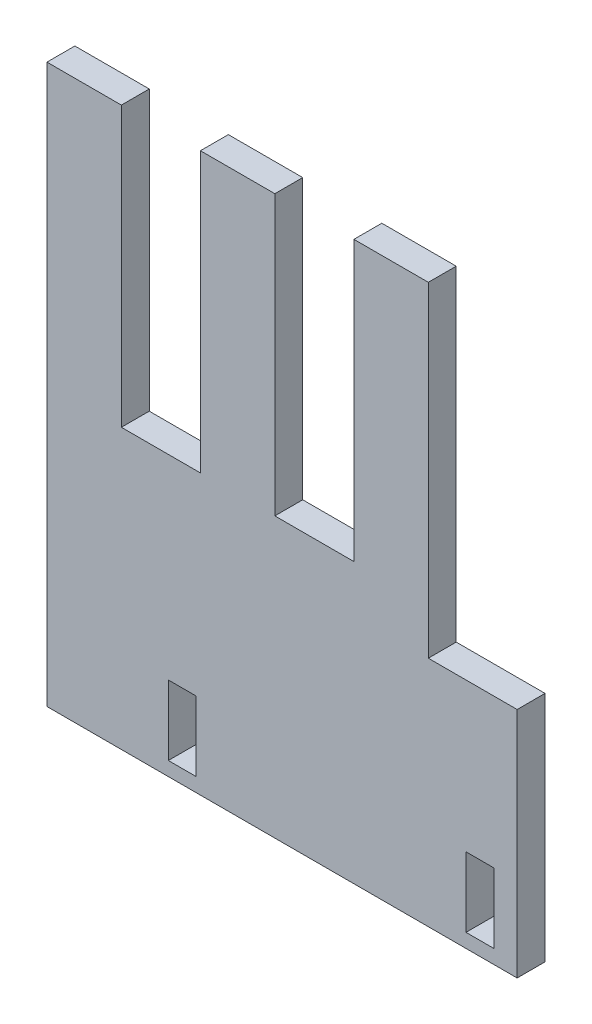
ISO-10303-21;
HEADER;
FILE_DESCRIPTION(('STEP AP214'),'2;1');
FILE_NAME('part.step','',(''),(''),'','','');
FILE_SCHEMA(('AUTOMOTIVE_DESIGN { 1 0 10303 214 1 1 1 1 }'));
ENDSEC;
DATA;
#1=APPLICATION_CONTEXT('core data for automotive mechanical design processes');
#2=APPLICATION_PROTOCOL_DEFINITION('international standard','automotive_design',2000,#1);
#3=PRODUCT_CONTEXT('',#1,'mechanical');
#4=PRODUCT('Part','Part','',(#3));
#5=PRODUCT_RELATED_PRODUCT_CATEGORY('part','',(#4));
#6=PRODUCT_DEFINITION_FORMATION('','',#4);
#7=PRODUCT_DEFINITION_CONTEXT('part definition',#1,'design');
#8=PRODUCT_DEFINITION('design','',#6,#7);
#9=PRODUCT_DEFINITION_SHAPE('','',#8);
#10=(LENGTH_UNIT() NAMED_UNIT(*) SI_UNIT(.MILLI.,.METRE.));
#11=(NAMED_UNIT(*) PLANE_ANGLE_UNIT() SI_UNIT($,.RADIAN.));
#12=(NAMED_UNIT(*) SI_UNIT($,.STERADIAN.) SOLID_ANGLE_UNIT());
#13=UNCERTAINTY_MEASURE_WITH_UNIT(LENGTH_MEASURE(1.E-05),#10,'distance_accuracy_value','');
#14=(GEOMETRIC_REPRESENTATION_CONTEXT(3) GLOBAL_UNCERTAINTY_ASSIGNED_CONTEXT((#13)) GLOBAL_UNIT_ASSIGNED_CONTEXT((#10,
#11,#12)) REPRESENTATION_CONTEXT('',''));
#15=CARTESIAN_POINT('',(0.,0.,0.));
#16=DIRECTION('',(0.,0.,1.));
#17=DIRECTION('',(1.,0.,0.));
#18=AXIS2_PLACEMENT_3D('',#15,#16,#17);
#19=CARTESIAN_POINT('',(0.,0.,6.));
#20=DIRECTION('',(0.,0.,1.));
#21=DIRECTION('',(1.,0.,0.));
#22=AXIS2_PLACEMENT_3D('',#19,#20,#21);
#23=PLANE('',#22);
#24=DIRECTION('',(-1.,0.,0.));
#25=VECTOR('',#24,1.);
#26=CARTESIAN_POINT('',(-24.8324162415232,47.3812849162011,6.));
#27=LINE('',#26,#25);
#28=CARTESIAN_POINT('',(-24.8324162415232,47.3812849162011,6.));
#29=VERTEX_POINT('',#28);
#30=CARTESIAN_POINT('',(-40.8324162415232,47.3812849162011,6.));
#31=VERTEX_POINT('',#30);
#32=EDGE_CURVE('E249',#29,#31,#27,.T.);
#33=ORIENTED_EDGE('',*,*,#32,.T.);
#34=DIRECTION('',(0.,-1.,0.));
#35=VECTOR('',#34,1.);
#36=CARTESIAN_POINT('',(-40.8324162415232,47.3812849162011,6.));
#37=LINE('',#36,#35);
#38=CARTESIAN_POINT('',(-40.8324162415232,-72.6187150837989,6.));
#39=VERTEX_POINT('',#38);
#40=EDGE_CURVE('E252',#31,#39,#37,.T.);
#41=ORIENTED_EDGE('',*,*,#40,.T.);
#42=DIRECTION('',(1.,0.,0.));
#43=VECTOR('',#42,1.);
#44=CARTESIAN_POINT('',(-40.8324162415232,-72.6187150837989,6.));
#45=LINE('',#44,#43);
#46=CARTESIAN_POINT('',(60.2675837584768,-72.6187150837989,6.));
#47=VERTEX_POINT('',#46);
#48=EDGE_CURVE('E255',#39,#47,#45,.T.);
#49=ORIENTED_EDGE('',*,*,#48,.T.);
#50=DIRECTION('',(0.,1.,0.));
#51=VECTOR('',#50,1.);
#52=CARTESIAN_POINT('',(60.2675837584768,-22.6187150837989,6.));
#53=LINE('',#52,#51);
#54=CARTESIAN_POINT('',(60.2675837584768,-22.6187150837989,6.));
#55=VERTEX_POINT('',#54);
#56=EDGE_CURVE('E257',#47,#55,#53,.T.);
#57=ORIENTED_EDGE('',*,*,#56,.T.);
#58=DIRECTION('',(-1.,0.,0.));
#59=VECTOR('',#58,1.);
#60=CARTESIAN_POINT('',(60.2675837584768,-22.6187150837989,6.));
#61=LINE('',#60,#59);
#62=CARTESIAN_POINT('',(41.1675837584769,-22.6187150837989,6.));
#63=VERTEX_POINT('',#62);
#64=EDGE_CURVE('E259',#55,#63,#61,.T.);
#65=ORIENTED_EDGE('',*,*,#64,.T.);
#66=DIRECTION('',(0.,1.,0.));
#67=VECTOR('',#66,1.);
#68=CARTESIAN_POINT('',(41.1675837584769,-22.6187150837989,6.));
#69=LINE('',#68,#67);
#70=CARTESIAN_POINT('',(41.1675837584769,47.3812849162011,6.));
#71=VERTEX_POINT('',#70);
#72=EDGE_CURVE('E261',#63,#71,#69,.T.);
#73=ORIENTED_EDGE('',*,*,#72,.T.);
#74=DIRECTION('',(-1.,0.,0.));
#75=VECTOR('',#74,1.);
#76=CARTESIAN_POINT('',(41.1675837584769,47.3812849162011,6.));
#77=LINE('',#76,#75);
#78=CARTESIAN_POINT('',(25.1675837584768,47.3812849162011,6.));
#79=VERTEX_POINT('',#78);
#80=EDGE_CURVE('E263',#71,#79,#77,.T.);
#81=ORIENTED_EDGE('',*,*,#80,.T.);
#82=DIRECTION('',(0.,-1.,0.));
#83=VECTOR('',#82,1.);
#84=CARTESIAN_POINT('',(25.1675837584768,47.3812849162011,6.));
#85=LINE('',#84,#83);
#86=CARTESIAN_POINT('',(25.1675837584769,-12.6187150837989,6.));
#87=VERTEX_POINT('',#86);
#88=EDGE_CURVE('E265',#79,#87,#85,.T.);
#89=ORIENTED_EDGE('',*,*,#88,.T.);
#90=DIRECTION('',(-1.,0.,0.));
#91=VECTOR('',#90,1.);
#92=CARTESIAN_POINT('',(25.1675837584769,-12.6187150837989,6.));
#93=LINE('',#92,#91);
#94=CARTESIAN_POINT('',(8.16758375847685,-12.6187150837989,6.));
#95=VERTEX_POINT('',#94);
#96=EDGE_CURVE('E267',#87,#95,#93,.T.);
#97=ORIENTED_EDGE('',*,*,#96,.T.);
#98=DIRECTION('',(0.,1.,0.));
#99=VECTOR('',#98,1.);
#100=CARTESIAN_POINT('',(8.16758375847685,-12.6187150837989,6.));
#101=LINE('',#100,#99);
#102=CARTESIAN_POINT('',(8.16758375847684,47.3812849162011,6.));
#103=VERTEX_POINT('',#102);
#104=EDGE_CURVE('E269',#95,#103,#101,.T.);
#105=ORIENTED_EDGE('',*,*,#104,.T.);
#106=DIRECTION('',(-1.,0.,0.));
#107=VECTOR('',#106,1.);
#108=CARTESIAN_POINT('',(8.16758375847684,47.3812849162011,6.));
#109=LINE('',#108,#107);
#110=CARTESIAN_POINT('',(-7.83241624152316,47.3812849162011,6.));
#111=VERTEX_POINT('',#110);
#112=EDGE_CURVE('E271',#103,#111,#109,.T.);
#113=ORIENTED_EDGE('',*,*,#112,.T.);
#114=DIRECTION('',(0.,-1.,0.));
#115=VECTOR('',#114,1.);
#116=CARTESIAN_POINT('',(-7.83241624152316,47.3812849162011,6.));
#117=LINE('',#116,#115);
#118=CARTESIAN_POINT('',(-7.83241624152316,-12.6187150837989,6.));
#119=VERTEX_POINT('',#118);
#120=EDGE_CURVE('E273',#111,#119,#117,.T.);
#121=ORIENTED_EDGE('',*,*,#120,.T.);
#122=DIRECTION('',(-1.,0.,0.));
#123=VECTOR('',#122,1.);
#124=CARTESIAN_POINT('',(-7.83241624152316,-12.6187150837989,6.));
#125=LINE('',#124,#123);
#126=CARTESIAN_POINT('',(-24.8324162415232,-12.6187150837989,6.));
#127=VERTEX_POINT('',#126);
#128=EDGE_CURVE('E275',#119,#127,#125,.T.);
#129=ORIENTED_EDGE('',*,*,#128,.T.);
#130=DIRECTION('',(0.,1.,0.));
#131=VECTOR('',#130,1.);
#132=CARTESIAN_POINT('',(-24.8324162415232,-12.6187150837989,6.));
#133=LINE('',#132,#131);
#134=EDGE_CURVE('E277',#127,#29,#133,.T.);
#135=ORIENTED_EDGE('',*,*,#134,.T.);
#136=EDGE_LOOP('',(#33,#41,#49,#57,#65,#73,#81,#89,#97,#105,#113,#121,#129,#135));
#137=FACE_BOUND('',#136,.T.);
#138=DIRECTION('',(-1.,0.,0.));
#139=VECTOR('',#138,1.);
#140=CARTESIAN_POINT('',(55.2675837584768,-54.6187150837989,6.));
#141=LINE('',#140,#139);
#142=CARTESIAN_POINT('',(55.2675837584768,-54.6187150837989,6.));
#143=VERTEX_POINT('',#142);
#144=CARTESIAN_POINT('',(49.2675837584768,-54.6187150837989,6.));
#145=VERTEX_POINT('',#144);
#146=EDGE_CURVE('E220',#143,#145,#141,.T.);
#147=ORIENTED_EDGE('',*,*,#146,.F.);
#148=DIRECTION('',(0.,1.,0.));
#149=VECTOR('',#148,1.);
#150=CARTESIAN_POINT('',(55.2675837584768,-54.6187150837989,6.));
#151=LINE('',#150,#149);
#152=CARTESIAN_POINT('',(55.2675837584768,-69.6187150837989,6.));
#153=VERTEX_POINT('',#152);
#154=EDGE_CURVE('E218',#153,#143,#151,.T.);
#155=ORIENTED_EDGE('',*,*,#154,.F.);
#156=DIRECTION('',(1.,0.,0.));
#157=VECTOR('',#156,1.);
#158=CARTESIAN_POINT('',(55.2675837584768,-69.6187150837989,6.));
#159=LINE('',#158,#157);
#160=CARTESIAN_POINT('',(49.2675837584768,-69.6187150837989,6.));
#161=VERTEX_POINT('',#160);
#162=EDGE_CURVE('E226',#161,#153,#159,.T.);
#163=ORIENTED_EDGE('',*,*,#162,.F.);
#164=DIRECTION('',(0.,-1.,0.));
#165=VECTOR('',#164,1.);
#166=CARTESIAN_POINT('',(49.2675837584768,-54.6187150837989,6.));
#167=LINE('',#166,#165);
#168=EDGE_CURVE('E223',#145,#161,#167,.T.);
#169=ORIENTED_EDGE('',*,*,#168,.F.);
#170=EDGE_LOOP('',(#147,#155,#163,#169));
#171=FACE_BOUND('',#170,.T.);
#172=DIRECTION('',(-1.,0.,0.));
#173=VECTOR('',#172,1.);
#174=CARTESIAN_POINT('',(-8.73241624152316,-54.6187150837989,6.));
#175=LINE('',#174,#173);
#176=CARTESIAN_POINT('',(-8.73241624152316,-54.6187150837989,6.));
#177=VERTEX_POINT('',#176);
#178=CARTESIAN_POINT('',(-14.7324162415232,-54.6187150837989,6.));
#179=VERTEX_POINT('',#178);
#180=EDGE_CURVE('E190',#177,#179,#175,.T.);
#181=ORIENTED_EDGE('',*,*,#180,.F.);
#182=DIRECTION('',(0.,1.,0.));
#183=VECTOR('',#182,1.);
#184=CARTESIAN_POINT('',(-8.73241624152316,-54.6187150837989,6.));
#185=LINE('',#184,#183);
#186=CARTESIAN_POINT('',(-8.73241624152316,-69.6187150837989,6.));
#187=VERTEX_POINT('',#186);
#188=EDGE_CURVE('E182',#187,#177,#185,.T.);
#189=ORIENTED_EDGE('',*,*,#188,.F.);
#190=DIRECTION('',(1.,0.,0.));
#191=VECTOR('',#190,1.);
#192=CARTESIAN_POINT('',(-8.73241624152316,-69.6187150837989,6.));
#193=LINE('',#192,#191);
#194=CARTESIAN_POINT('',(-14.7324162415232,-69.6187150837989,6.));
#195=VERTEX_POINT('',#194);
#196=EDGE_CURVE('E204',#195,#187,#193,.T.);
#197=ORIENTED_EDGE('',*,*,#196,.F.);
#198=DIRECTION('',(0.,-1.,0.));
#199=VECTOR('',#198,1.);
#200=CARTESIAN_POINT('',(-14.7324162415232,-54.6187150837989,6.));
#201=LINE('',#200,#199);
#202=EDGE_CURVE('E202',#179,#195,#201,.T.);
#203=ORIENTED_EDGE('',*,*,#202,.F.);
#204=EDGE_LOOP('',(#181,#189,#197,#203));
#205=FACE_BOUND('',#204,.T.);
#206=ADVANCED_FACE('F33',(#137,#171,#205),#23,.T.);
#207=CARTESIAN_POINT('',(0.,0.,0.));
#208=DIRECTION('',(0.,0.,1.));
#209=DIRECTION('',(1.,0.,0.));
#210=AXIS2_PLACEMENT_3D('',#207,#208,#209);
#211=PLANE('',#210);
#212=DIRECTION('',(0.,1.,0.));
#213=VECTOR('',#212,1.);
#214=CARTESIAN_POINT('',(55.2675837584768,-54.6187150837989,0.));
#215=LINE('',#214,#213);
#216=CARTESIAN_POINT('',(55.2675837584768,-69.6187150837989,0.));
#217=VERTEX_POINT('',#216);
#218=CARTESIAN_POINT('',(55.2675837584768,-54.6187150837989,0.));
#219=VERTEX_POINT('',#218);
#220=EDGE_CURVE('E198',#217,#219,#215,.T.);
#221=ORIENTED_EDGE('',*,*,#220,.T.);
#222=DIRECTION('',(-1.,0.,0.));
#223=VECTOR('',#222,1.);
#224=CARTESIAN_POINT('',(55.2675837584768,-54.6187150837989,0.));
#225=LINE('',#224,#223);
#226=CARTESIAN_POINT('',(49.2675837584768,-54.6187150837989,0.));
#227=VERTEX_POINT('',#226);
#228=EDGE_CURVE('E231',#219,#227,#225,.T.);
#229=ORIENTED_EDGE('',*,*,#228,.T.);
#230=DIRECTION('',(0.,-1.,0.));
#231=VECTOR('',#230,1.);
#232=CARTESIAN_POINT('',(49.2675837584768,-54.6187150837989,0.));
#233=LINE('',#232,#231);
#234=CARTESIAN_POINT('',(49.2675837584768,-69.6187150837989,0.));
#235=VERTEX_POINT('',#234);
#236=EDGE_CURVE('E234',#227,#235,#233,.T.);
#237=ORIENTED_EDGE('',*,*,#236,.T.);
#238=DIRECTION('',(1.,0.,0.));
#239=VECTOR('',#238,1.);
#240=CARTESIAN_POINT('',(55.2675837584768,-69.6187150837989,0.));
#241=LINE('',#240,#239);
#242=EDGE_CURVE('E221',#235,#217,#241,.T.);
#243=ORIENTED_EDGE('',*,*,#242,.T.);
#244=EDGE_LOOP('',(#221,#229,#237,#243));
#245=FACE_BOUND('',#244,.T.);
#246=DIRECTION('',(-1.,0.,0.));
#247=VECTOR('',#246,1.);
#248=CARTESIAN_POINT('',(-24.8324162415232,47.3812849162011,0.));
#249=LINE('',#248,#247);
#250=CARTESIAN_POINT('',(-24.8324162415232,47.3812849162011,0.));
#251=VERTEX_POINT('',#250);
#252=CARTESIAN_POINT('',(-40.8324162415232,47.3812849162011,0.));
#253=VERTEX_POINT('',#252);
#254=EDGE_CURVE('E248',#251,#253,#249,.T.);
#255=ORIENTED_EDGE('',*,*,#254,.F.);
#256=DIRECTION('',(0.,1.,0.));
#257=VECTOR('',#256,1.);
#258=CARTESIAN_POINT('',(-24.8324162415232,-12.6187150837989,0.));
#259=LINE('',#258,#257);
#260=CARTESIAN_POINT('',(-24.8324162415232,-12.6187150837989,0.));
#261=VERTEX_POINT('',#260);
#262=EDGE_CURVE('E253',#261,#251,#259,.T.);
#263=ORIENTED_EDGE('',*,*,#262,.F.);
#264=DIRECTION('',(-1.,0.,0.));
#265=VECTOR('',#264,1.);
#266=CARTESIAN_POINT('',(-7.83241624152316,-12.6187150837989,0.));
#267=LINE('',#266,#265);
#268=CARTESIAN_POINT('',(-7.83241624152316,-12.6187150837989,0.));
#269=VERTEX_POINT('',#268);
#270=EDGE_CURVE('E304',#269,#261,#267,.T.);
#271=ORIENTED_EDGE('',*,*,#270,.F.);
#272=DIRECTION('',(0.,-1.,0.));
#273=VECTOR('',#272,1.);
#274=CARTESIAN_POINT('',(-7.83241624152316,47.3812849162011,0.));
#275=LINE('',#274,#273);
#276=CARTESIAN_POINT('',(-7.83241624152316,47.3812849162011,0.));
#277=VERTEX_POINT('',#276);
#278=EDGE_CURVE('E302',#277,#269,#275,.T.);
#279=ORIENTED_EDGE('',*,*,#278,.F.);
#280=DIRECTION('',(-1.,0.,0.));
#281=VECTOR('',#280,1.);
#282=CARTESIAN_POINT('',(8.16758375847684,47.3812849162011,0.));
#283=LINE('',#282,#281);
#284=CARTESIAN_POINT('',(8.16758375847684,47.3812849162011,0.));
#285=VERTEX_POINT('',#284);
#286=EDGE_CURVE('E300',#285,#277,#283,.T.);
#287=ORIENTED_EDGE('',*,*,#286,.F.);
#288=DIRECTION('',(0.,1.,0.));
#289=VECTOR('',#288,1.);
#290=CARTESIAN_POINT('',(8.16758375847685,-12.6187150837989,0.));
#291=LINE('',#290,#289);
#292=CARTESIAN_POINT('',(8.16758375847685,-12.6187150837989,0.));
#293=VERTEX_POINT('',#292);
#294=EDGE_CURVE('E298',#293,#285,#291,.T.);
#295=ORIENTED_EDGE('',*,*,#294,.F.);
#296=DIRECTION('',(-1.,0.,0.));
#297=VECTOR('',#296,1.);
#298=CARTESIAN_POINT('',(25.1675837584769,-12.6187150837989,0.));
#299=LINE('',#298,#297);
#300=CARTESIAN_POINT('',(25.1675837584769,-12.6187150837989,0.));
#301=VERTEX_POINT('',#300);
#302=EDGE_CURVE('E296',#301,#293,#299,.T.);
#303=ORIENTED_EDGE('',*,*,#302,.F.);
#304=DIRECTION('',(0.,-1.,0.));
#305=VECTOR('',#304,1.);
#306=CARTESIAN_POINT('',(25.1675837584768,47.3812849162011,0.));
#307=LINE('',#306,#305);
#308=CARTESIAN_POINT('',(25.1675837584768,47.3812849162011,0.));
#309=VERTEX_POINT('',#308);
#310=EDGE_CURVE('E294',#309,#301,#307,.T.);
#311=ORIENTED_EDGE('',*,*,#310,.F.);
#312=DIRECTION('',(-1.,0.,0.));
#313=VECTOR('',#312,1.);
#314=CARTESIAN_POINT('',(41.1675837584769,47.3812849162011,0.));
#315=LINE('',#314,#313);
#316=CARTESIAN_POINT('',(41.1675837584769,47.3812849162011,0.));
#317=VERTEX_POINT('',#316);
#318=EDGE_CURVE('E292',#317,#309,#315,.T.);
#319=ORIENTED_EDGE('',*,*,#318,.F.);
#320=DIRECTION('',(0.,1.,0.));
#321=VECTOR('',#320,1.);
#322=CARTESIAN_POINT('',(41.1675837584769,-22.6187150837989,0.));
#323=LINE('',#322,#321);
#324=CARTESIAN_POINT('',(41.1675837584769,-22.6187150837989,0.));
#325=VERTEX_POINT('',#324);
#326=EDGE_CURVE('E290',#325,#317,#323,.T.);
#327=ORIENTED_EDGE('',*,*,#326,.F.);
#328=DIRECTION('',(-1.,0.,0.));
#329=VECTOR('',#328,1.);
#330=CARTESIAN_POINT('',(60.2675837584768,-22.6187150837989,0.));
#331=LINE('',#330,#329);
#332=CARTESIAN_POINT('',(60.2675837584768,-22.6187150837989,0.));
#333=VERTEX_POINT('',#332);
#334=EDGE_CURVE('E288',#333,#325,#331,.T.);
#335=ORIENTED_EDGE('',*,*,#334,.F.);
#336=DIRECTION('',(0.,1.,0.));
#337=VECTOR('',#336,1.);
#338=CARTESIAN_POINT('',(60.2675837584768,-22.6187150837989,0.));
#339=LINE('',#338,#337);
#340=CARTESIAN_POINT('',(60.2675837584768,-72.6187150837989,0.));
#341=VERTEX_POINT('',#340);
#342=EDGE_CURVE('E286',#341,#333,#339,.T.);
#343=ORIENTED_EDGE('',*,*,#342,.F.);
#344=DIRECTION('',(1.,0.,0.));
#345=VECTOR('',#344,1.);
#346=CARTESIAN_POINT('',(-40.8324162415232,-72.6187150837989,0.));
#347=LINE('',#346,#345);
#348=CARTESIAN_POINT('',(-40.8324162415232,-72.6187150837989,0.));
#349=VERTEX_POINT('',#348);
#350=EDGE_CURVE('E284',#349,#341,#347,.T.);
#351=ORIENTED_EDGE('',*,*,#350,.F.);
#352=DIRECTION('',(0.,-1.,0.));
#353=VECTOR('',#352,1.);
#354=CARTESIAN_POINT('',(-40.8324162415232,47.3812849162011,0.));
#355=LINE('',#354,#353);
#356=EDGE_CURVE('E282',#253,#349,#355,.T.);
#357=ORIENTED_EDGE('',*,*,#356,.F.);
#358=EDGE_LOOP('',(#255,#263,#271,#279,#287,#295,#303,#311,#319,#327,#335,#343,#351,#357));
#359=FACE_BOUND('',#358,.T.);
#360=DIRECTION('',(0.,1.,0.));
#361=VECTOR('',#360,1.);
#362=CARTESIAN_POINT('',(-8.73241624152316,-54.6187150837989,0.));
#363=LINE('',#362,#361);
#364=CARTESIAN_POINT('',(-8.73241624152316,-69.6187150837989,0.));
#365=VERTEX_POINT('',#364);
#366=CARTESIAN_POINT('',(-8.73241624152316,-54.6187150837989,0.));
#367=VERTEX_POINT('',#366);
#368=EDGE_CURVE('E56',#365,#367,#363,.T.);
#369=ORIENTED_EDGE('',*,*,#368,.T.);
#370=DIRECTION('',(-1.,0.,0.));
#371=VECTOR('',#370,1.);
#372=CARTESIAN_POINT('',(-8.73241624152316,-54.6187150837989,0.));
#373=LINE('',#372,#371);
#374=CARTESIAN_POINT('',(-14.7324162415232,-54.6187150837989,0.));
#375=VERTEX_POINT('',#374);
#376=EDGE_CURVE('E197',#367,#375,#373,.T.);
#377=ORIENTED_EDGE('',*,*,#376,.T.);
#378=DIRECTION('',(0.,-1.,0.));
#379=VECTOR('',#378,1.);
#380=CARTESIAN_POINT('',(-14.7324162415232,-54.6187150837989,0.));
#381=LINE('',#380,#379);
#382=CARTESIAN_POINT('',(-14.7324162415232,-69.6187150837989,0.));
#383=VERTEX_POINT('',#382);
#384=EDGE_CURVE('E210',#375,#383,#381,.T.);
#385=ORIENTED_EDGE('',*,*,#384,.T.);
#386=DIRECTION('',(1.,0.,0.));
#387=VECTOR('',#386,1.);
#388=CARTESIAN_POINT('',(-8.73241624152316,-69.6187150837989,0.));
#389=LINE('',#388,#387);
#390=EDGE_CURVE('E191',#383,#365,#389,.T.);
#391=ORIENTED_EDGE('',*,*,#390,.T.);
#392=EDGE_LOOP('',(#369,#377,#385,#391));
#393=FACE_BOUND('',#392,.T.);
#394=ADVANCED_FACE('F352',(#245,#359,#393),#211,.F.);
#395=CARTESIAN_POINT('',(-24.8324162415232,47.3812849162011,6.));
#396=DIRECTION('',(0.,-1.,0.));
#397=DIRECTION('',(1.,0.,0.));
#398=AXIS2_PLACEMENT_3D('',#395,#396,#397);
#399=PLANE('',#398);
#400=ORIENTED_EDGE('',*,*,#254,.T.);
#401=DIRECTION('',(0.,0.,-1.));
#402=VECTOR('',#401,1.);
#403=CARTESIAN_POINT('',(-40.8324162415232,47.3812849162011,6.));
#404=LINE('',#403,#402);
#405=EDGE_CURVE('E11',#31,#253,#404,.T.);
#406=ORIENTED_EDGE('',*,*,#405,.F.);
#407=ORIENTED_EDGE('',*,*,#32,.F.);
#408=DIRECTION('',(0.,0.,-1.));
#409=VECTOR('',#408,1.);
#410=CARTESIAN_POINT('',(-24.8324162415232,47.3812849162011,6.));
#411=LINE('',#410,#409);
#412=EDGE_CURVE('E279',#29,#251,#411,.T.);
#413=ORIENTED_EDGE('',*,*,#412,.T.);
#414=EDGE_LOOP('',(#400,#406,#407,#413));
#415=FACE_BOUND('',#414,.T.);
#416=ADVANCED_FACE('F35',(#415),#399,.F.);
#417=CARTESIAN_POINT('',(-40.8324162415232,47.3812849162011,6.));
#418=DIRECTION('',(1.,0.,0.));
#419=DIRECTION('',(0.,1.,0.));
#420=AXIS2_PLACEMENT_3D('',#417,#418,#419);
#421=PLANE('',#420);
#422=ORIENTED_EDGE('',*,*,#356,.T.);
#423=DIRECTION('',(0.,0.,-1.));
#424=VECTOR('',#423,1.);
#425=CARTESIAN_POINT('',(-40.8324162415232,-72.6187150837989,6.));
#426=LINE('',#425,#424);
#427=EDGE_CURVE('E41',#39,#349,#426,.T.);
#428=ORIENTED_EDGE('',*,*,#427,.F.);
#429=ORIENTED_EDGE('',*,*,#40,.F.);
#430=ORIENTED_EDGE('',*,*,#405,.T.);
#431=EDGE_LOOP('',(#422,#428,#429,#430));
#432=FACE_BOUND('',#431,.T.);
#433=ADVANCED_FACE('F370',(#432),#421,.F.);
#434=CARTESIAN_POINT('',(-40.8324162415232,-72.6187150837989,6.));
#435=DIRECTION('',(0.,1.,0.));
#436=DIRECTION('',(0.,0.,1.));
#437=AXIS2_PLACEMENT_3D('',#434,#435,#436);
#438=PLANE('',#437);
#439=ORIENTED_EDGE('',*,*,#350,.T.);
#440=DIRECTION('',(0.,0.,-1.));
#441=VECTOR('',#440,1.);
#442=CARTESIAN_POINT('',(60.2675837584768,-72.6187150837989,6.));
#443=LINE('',#442,#441);
#444=EDGE_CURVE('E339',#47,#341,#443,.T.);
#445=ORIENTED_EDGE('',*,*,#444,.F.);
#446=ORIENTED_EDGE('',*,*,#48,.F.);
#447=ORIENTED_EDGE('',*,*,#427,.T.);
#448=EDGE_LOOP('',(#439,#445,#446,#447));
#449=FACE_BOUND('',#448,.T.);
#450=ADVANCED_FACE('F346',(#449),#438,.F.);
#451=CARTESIAN_POINT('',(60.2675837584768,-22.6187150837989,6.));
#452=DIRECTION('',(-1.,0.,0.));
#453=DIRECTION('',(0.,0.,1.));
#454=AXIS2_PLACEMENT_3D('',#451,#452,#453);
#455=PLANE('',#454);
#456=ORIENTED_EDGE('',*,*,#342,.T.);
#457=DIRECTION('',(0.,0.,-1.));
#458=VECTOR('',#457,1.);
#459=CARTESIAN_POINT('',(60.2675837584768,-22.6187150837989,6.));
#460=LINE('',#459,#458);
#461=EDGE_CURVE('E336',#55,#333,#460,.T.);
#462=ORIENTED_EDGE('',*,*,#461,.F.);
#463=ORIENTED_EDGE('',*,*,#56,.F.);
#464=ORIENTED_EDGE('',*,*,#444,.T.);
#465=EDGE_LOOP('',(#456,#462,#463,#464));
#466=FACE_BOUND('',#465,.T.);
#467=ADVANCED_FACE('F358',(#466),#455,.F.);
#468=CARTESIAN_POINT('',(60.2675837584768,-22.6187150837989,6.));
#469=DIRECTION('',(0.,-1.,0.));
#470=DIRECTION('',(0.,0.,-1.));
#471=AXIS2_PLACEMENT_3D('',#468,#469,#470);
#472=PLANE('',#471);
#473=ORIENTED_EDGE('',*,*,#334,.T.);
#474=DIRECTION('',(0.,0.,-1.));
#475=VECTOR('',#474,1.);
#476=CARTESIAN_POINT('',(41.1675837584769,-22.6187150837989,6.));
#477=LINE('',#476,#475);
#478=EDGE_CURVE('E333',#63,#325,#477,.T.);
#479=ORIENTED_EDGE('',*,*,#478,.F.);
#480=ORIENTED_EDGE('',*,*,#64,.F.);
#481=ORIENTED_EDGE('',*,*,#461,.T.);
#482=EDGE_LOOP('',(#473,#479,#480,#481));
#483=FACE_BOUND('',#482,.T.);
#484=ADVANCED_FACE('F362',(#483),#472,.F.);
#485=CARTESIAN_POINT('',(41.1675837584769,-22.6187150837989,6.));
#486=DIRECTION('',(-1.,0.,0.));
#487=DIRECTION('',(0.,-1.,0.));
#488=AXIS2_PLACEMENT_3D('',#485,#486,#487);
#489=PLANE('',#488);
#490=ORIENTED_EDGE('',*,*,#326,.T.);
#491=DIRECTION('',(0.,0.,-1.));
#492=VECTOR('',#491,1.);
#493=CARTESIAN_POINT('',(41.1675837584769,47.3812849162011,6.));
#494=LINE('',#493,#492);
#495=EDGE_CURVE('E330',#71,#317,#494,.T.);
#496=ORIENTED_EDGE('',*,*,#495,.F.);
#497=ORIENTED_EDGE('',*,*,#72,.F.);
#498=ORIENTED_EDGE('',*,*,#478,.T.);
#499=EDGE_LOOP('',(#490,#496,#497,#498));
#500=FACE_BOUND('',#499,.T.);
#501=ADVANCED_FACE('F413',(#500),#489,.F.);
#502=CARTESIAN_POINT('',(41.1675837584769,47.3812849162011,6.));
#503=DIRECTION('',(0.,-1.,0.));
#504=DIRECTION('',(1.,0.,0.));
#505=AXIS2_PLACEMENT_3D('',#502,#503,#504);
#506=PLANE('',#505);
#507=ORIENTED_EDGE('',*,*,#318,.T.);
#508=DIRECTION('',(0.,0.,-1.));
#509=VECTOR('',#508,1.);
#510=CARTESIAN_POINT('',(25.1675837584768,47.3812849162011,6.));
#511=LINE('',#510,#509);
#512=EDGE_CURVE('E327',#79,#309,#511,.T.);
#513=ORIENTED_EDGE('',*,*,#512,.F.);
#514=ORIENTED_EDGE('',*,*,#80,.F.);
#515=ORIENTED_EDGE('',*,*,#495,.T.);
#516=EDGE_LOOP('',(#507,#513,#514,#515));
#517=FACE_BOUND('',#516,.T.);
#518=ADVANCED_FACE('F411',(#517),#506,.F.);
#519=CARTESIAN_POINT('',(25.1675837584768,47.3812849162011,6.));
#520=DIRECTION('',(1.,0.,0.));
#521=DIRECTION('',(0.,1.,0.));
#522=AXIS2_PLACEMENT_3D('',#519,#520,#521);
#523=PLANE('',#522);
#524=ORIENTED_EDGE('',*,*,#310,.T.);
#525=DIRECTION('',(0.,0.,-1.));
#526=VECTOR('',#525,1.);
#527=CARTESIAN_POINT('',(25.1675837584769,-12.6187150837989,6.));
#528=LINE('',#527,#526);
#529=EDGE_CURVE('E324',#87,#301,#528,.T.);
#530=ORIENTED_EDGE('',*,*,#529,.F.);
#531=ORIENTED_EDGE('',*,*,#88,.F.);
#532=ORIENTED_EDGE('',*,*,#512,.T.);
#533=EDGE_LOOP('',(#524,#530,#531,#532));
#534=FACE_BOUND('',#533,.T.);
#535=ADVANCED_FACE('F406',(#534),#523,.F.);
#536=CARTESIAN_POINT('',(25.1675837584769,-12.6187150837989,6.));
#537=DIRECTION('',(0.,-1.,0.));
#538=DIRECTION('',(1.,0.,0.));
#539=AXIS2_PLACEMENT_3D('',#536,#537,#538);
#540=PLANE('',#539);
#541=ORIENTED_EDGE('',*,*,#302,.T.);
#542=DIRECTION('',(0.,0.,-1.));
#543=VECTOR('',#542,1.);
#544=CARTESIAN_POINT('',(8.16758375847685,-12.6187150837989,6.));
#545=LINE('',#544,#543);
#546=EDGE_CURVE('E321',#95,#293,#545,.T.);
#547=ORIENTED_EDGE('',*,*,#546,.F.);
#548=ORIENTED_EDGE('',*,*,#96,.F.);
#549=ORIENTED_EDGE('',*,*,#529,.T.);
#550=EDGE_LOOP('',(#541,#547,#548,#549));
#551=FACE_BOUND('',#550,.T.);
#552=ADVANCED_FACE('F401',(#551),#540,.F.);
#553=CARTESIAN_POINT('',(8.16758375847685,-12.6187150837989,6.));
#554=DIRECTION('',(-1.,0.,0.));
#555=DIRECTION('',(0.,-1.,0.));
#556=AXIS2_PLACEMENT_3D('',#553,#554,#555);
#557=PLANE('',#556);
#558=ORIENTED_EDGE('',*,*,#294,.T.);
#559=DIRECTION('',(0.,0.,-1.));
#560=VECTOR('',#559,1.);
#561=CARTESIAN_POINT('',(8.16758375847684,47.3812849162011,6.));
#562=LINE('',#561,#560);
#563=EDGE_CURVE('E318',#103,#285,#562,.T.);
#564=ORIENTED_EDGE('',*,*,#563,.F.);
#565=ORIENTED_EDGE('',*,*,#104,.F.);
#566=ORIENTED_EDGE('',*,*,#546,.T.);
#567=EDGE_LOOP('',(#558,#564,#565,#566));
#568=FACE_BOUND('',#567,.T.);
#569=ADVANCED_FACE('F397',(#568),#557,.F.);
#570=CARTESIAN_POINT('',(8.16758375847684,47.3812849162011,6.));
#571=DIRECTION('',(0.,-1.,0.));
#572=DIRECTION('',(0.,0.,-1.));
#573=AXIS2_PLACEMENT_3D('',#570,#571,#572);
#574=PLANE('',#573);
#575=ORIENTED_EDGE('',*,*,#286,.T.);
#576=DIRECTION('',(0.,0.,-1.));
#577=VECTOR('',#576,1.);
#578=CARTESIAN_POINT('',(-7.83241624152316,47.3812849162011,6.));
#579=LINE('',#578,#577);
#580=EDGE_CURVE('E315',#111,#277,#579,.T.);
#581=ORIENTED_EDGE('',*,*,#580,.F.);
#582=ORIENTED_EDGE('',*,*,#112,.F.);
#583=ORIENTED_EDGE('',*,*,#563,.T.);
#584=EDGE_LOOP('',(#575,#581,#582,#583));
#585=FACE_BOUND('',#584,.T.);
#586=ADVANCED_FACE('F392',(#585),#574,.F.);
#587=CARTESIAN_POINT('',(-7.83241624152316,47.3812849162011,6.));
#588=DIRECTION('',(1.,0.,0.));
#589=DIRECTION('',(0.,1.,0.));
#590=AXIS2_PLACEMENT_3D('',#587,#588,#589);
#591=PLANE('',#590);
#592=ORIENTED_EDGE('',*,*,#278,.T.);
#593=DIRECTION('',(0.,0.,-1.));
#594=VECTOR('',#593,1.);
#595=CARTESIAN_POINT('',(-7.83241624152316,-12.6187150837989,6.));
#596=LINE('',#595,#594);
#597=EDGE_CURVE('E312',#119,#269,#596,.T.);
#598=ORIENTED_EDGE('',*,*,#597,.F.);
#599=ORIENTED_EDGE('',*,*,#120,.F.);
#600=ORIENTED_EDGE('',*,*,#580,.T.);
#601=EDGE_LOOP('',(#592,#598,#599,#600));
#602=FACE_BOUND('',#601,.T.);
#603=ADVANCED_FACE('F386',(#602),#591,.F.);
#604=CARTESIAN_POINT('',(-7.83241624152316,-12.6187150837989,6.));
#605=DIRECTION('',(0.,-1.,0.));
#606=DIRECTION('',(1.,0.,0.));
#607=AXIS2_PLACEMENT_3D('',#604,#605,#606);
#608=PLANE('',#607);
#609=ORIENTED_EDGE('',*,*,#270,.T.);
#610=DIRECTION('',(0.,0.,-1.));
#611=VECTOR('',#610,1.);
#612=CARTESIAN_POINT('',(-24.8324162415232,-12.6187150837989,6.));
#613=LINE('',#612,#611);
#614=EDGE_CURVE('E309',#127,#261,#613,.T.);
#615=ORIENTED_EDGE('',*,*,#614,.F.);
#616=ORIENTED_EDGE('',*,*,#128,.F.);
#617=ORIENTED_EDGE('',*,*,#597,.T.);
#618=EDGE_LOOP('',(#609,#615,#616,#617));
#619=FACE_BOUND('',#618,.T.);
#620=ADVANCED_FACE('F382',(#619),#608,.F.);
#621=CARTESIAN_POINT('',(-24.8324162415232,-12.6187150837989,6.));
#622=DIRECTION('',(-1.,0.,0.));
#623=DIRECTION('',(0.,-1.,0.));
#624=AXIS2_PLACEMENT_3D('',#621,#622,#623);
#625=PLANE('',#624);
#626=ORIENTED_EDGE('',*,*,#262,.T.);
#627=ORIENTED_EDGE('',*,*,#412,.F.);
#628=ORIENTED_EDGE('',*,*,#134,.F.);
#629=ORIENTED_EDGE('',*,*,#614,.T.);
#630=EDGE_LOOP('',(#626,#627,#628,#629));
#631=FACE_BOUND('',#630,.T.);
#632=ADVANCED_FACE('F377',(#631),#625,.F.);
#633=CARTESIAN_POINT('',(55.2675837584768,-54.6187150837989,6.));
#634=DIRECTION('',(-1.,0.,0.));
#635=DIRECTION('',(0.,0.,1.));
#636=AXIS2_PLACEMENT_3D('',#633,#634,#635);
#637=PLANE('',#636);
#638=ORIENTED_EDGE('',*,*,#220,.F.);
#639=DIRECTION('',(0.,0.,-1.));
#640=VECTOR('',#639,1.);
#641=CARTESIAN_POINT('',(55.2675837584768,-69.6187150837989,6.));
#642=LINE('',#641,#640);
#643=EDGE_CURVE('E228',#153,#217,#642,.T.);
#644=ORIENTED_EDGE('',*,*,#643,.F.);
#645=ORIENTED_EDGE('',*,*,#154,.T.);
#646=DIRECTION('',(0.,0.,-1.));
#647=VECTOR('',#646,1.);
#648=CARTESIAN_POINT('',(55.2675837584768,-54.6187150837989,6.));
#649=LINE('',#648,#647);
#650=EDGE_CURVE('E245',#143,#219,#649,.T.);
#651=ORIENTED_EDGE('',*,*,#650,.T.);
#652=EDGE_LOOP('',(#638,#644,#645,#651));
#653=FACE_BOUND('',#652,.T.);
#654=ADVANCED_FACE('F430',(#653),#637,.T.);
#655=CARTESIAN_POINT('',(55.2675837584768,-54.6187150837989,6.));
#656=DIRECTION('',(0.,-1.,0.));
#657=DIRECTION('',(0.,0.,-1.));
#658=AXIS2_PLACEMENT_3D('',#655,#656,#657);
#659=PLANE('',#658);
#660=ORIENTED_EDGE('',*,*,#228,.F.);
#661=ORIENTED_EDGE('',*,*,#650,.F.);
#662=ORIENTED_EDGE('',*,*,#146,.T.);
#663=DIRECTION('',(0.,0.,-1.));
#664=VECTOR('',#663,1.);
#665=CARTESIAN_POINT('',(49.2675837584768,-54.6187150837989,6.));
#666=LINE('',#665,#664);
#667=EDGE_CURVE('E243',#145,#227,#666,.T.);
#668=ORIENTED_EDGE('',*,*,#667,.T.);
#669=EDGE_LOOP('',(#660,#661,#662,#668));
#670=FACE_BOUND('',#669,.T.);
#671=ADVANCED_FACE('F480',(#670),#659,.T.);
#672=CARTESIAN_POINT('',(49.2675837584768,-54.6187150837989,6.));
#673=DIRECTION('',(1.,0.,0.));
#674=DIRECTION('',(0.,0.,-1.));
#675=AXIS2_PLACEMENT_3D('',#672,#673,#674);
#676=PLANE('',#675);
#677=ORIENTED_EDGE('',*,*,#236,.F.);
#678=ORIENTED_EDGE('',*,*,#667,.F.);
#679=ORIENTED_EDGE('',*,*,#168,.T.);
#680=DIRECTION('',(0.,0.,-1.));
#681=VECTOR('',#680,1.);
#682=CARTESIAN_POINT('',(49.2675837584768,-69.6187150837989,6.));
#683=LINE('',#682,#681);
#684=EDGE_CURVE('E241',#161,#235,#683,.T.);
#685=ORIENTED_EDGE('',*,*,#684,.T.);
#686=EDGE_LOOP('',(#677,#678,#679,#685));
#687=FACE_BOUND('',#686,.T.);
#688=ADVANCED_FACE('F487',(#687),#676,.T.);
#689=CARTESIAN_POINT('',(55.2675837584768,-69.6187150837989,6.));
#690=DIRECTION('',(0.,1.,0.));
#691=DIRECTION('',(0.,0.,1.));
#692=AXIS2_PLACEMENT_3D('',#689,#690,#691);
#693=PLANE('',#692);
#694=ORIENTED_EDGE('',*,*,#242,.F.);
#695=ORIENTED_EDGE('',*,*,#684,.F.);
#696=ORIENTED_EDGE('',*,*,#162,.T.);
#697=ORIENTED_EDGE('',*,*,#643,.T.);
#698=EDGE_LOOP('',(#694,#695,#696,#697));
#699=FACE_BOUND('',#698,.T.);
#700=ADVANCED_FACE('F494',(#699),#693,.T.);
#701=CARTESIAN_POINT('',(-8.73241624152316,-54.6187150837989,6.));
#702=DIRECTION('',(-1.,0.,0.));
#703=DIRECTION('',(0.,0.,1.));
#704=AXIS2_PLACEMENT_3D('',#701,#702,#703);
#705=PLANE('',#704);
#706=ORIENTED_EDGE('',*,*,#368,.F.);
#707=DIRECTION('',(0.,0.,-1.));
#708=VECTOR('',#707,1.);
#709=CARTESIAN_POINT('',(-8.73241624152316,-69.6187150837989,6.));
#710=LINE('',#709,#708);
#711=EDGE_CURVE('E186',#187,#365,#710,.T.);
#712=ORIENTED_EDGE('',*,*,#711,.F.);
#713=ORIENTED_EDGE('',*,*,#188,.T.);
#714=DIRECTION('',(0.,0.,-1.));
#715=VECTOR('',#714,1.);
#716=CARTESIAN_POINT('',(-8.73241624152316,-54.6187150837989,6.));
#717=LINE('',#716,#715);
#718=EDGE_CURVE('E185',#177,#367,#717,.T.);
#719=ORIENTED_EDGE('',*,*,#718,.T.);
#720=EDGE_LOOP('',(#706,#712,#713,#719));
#721=FACE_BOUND('',#720,.T.);
#722=ADVANCED_FACE('F184',(#721),#705,.T.);
#723=CARTESIAN_POINT('',(-8.73241624152316,-54.6187150837989,6.));
#724=DIRECTION('',(0.,-1.,0.));
#725=DIRECTION('',(1.,0.,0.));
#726=AXIS2_PLACEMENT_3D('',#723,#724,#725);
#727=PLANE('',#726);
#728=ORIENTED_EDGE('',*,*,#376,.F.);
#729=ORIENTED_EDGE('',*,*,#718,.F.);
#730=ORIENTED_EDGE('',*,*,#180,.T.);
#731=DIRECTION('',(0.,0.,-1.));
#732=VECTOR('',#731,1.);
#733=CARTESIAN_POINT('',(-14.7324162415232,-54.6187150837989,6.));
#734=LINE('',#733,#732);
#735=EDGE_CURVE('E199',#179,#375,#734,.T.);
#736=ORIENTED_EDGE('',*,*,#735,.T.);
#737=EDGE_LOOP('',(#728,#729,#730,#736));
#738=FACE_BOUND('',#737,.T.);
#739=ADVANCED_FACE('F194',(#738),#727,.T.);
#740=CARTESIAN_POINT('',(-14.7324162415232,-54.6187150837989,6.));
#741=DIRECTION('',(1.,0.,0.));
#742=DIRECTION('',(0.,1.,0.));
#743=AXIS2_PLACEMENT_3D('',#740,#741,#742);
#744=PLANE('',#743);
#745=ORIENTED_EDGE('',*,*,#384,.F.);
#746=ORIENTED_EDGE('',*,*,#735,.F.);
#747=ORIENTED_EDGE('',*,*,#202,.T.);
#748=DIRECTION('',(0.,0.,-1.));
#749=VECTOR('',#748,1.);
#750=CARTESIAN_POINT('',(-14.7324162415232,-69.6187150837989,6.));
#751=LINE('',#750,#749);
#752=EDGE_CURVE('E48',#195,#383,#751,.T.);
#753=ORIENTED_EDGE('',*,*,#752,.T.);
#754=EDGE_LOOP('',(#745,#746,#747,#753));
#755=FACE_BOUND('',#754,.T.);
#756=ADVANCED_FACE('F515',(#755),#744,.T.);
#757=CARTESIAN_POINT('',(-8.73241624152316,-69.6187150837989,6.));
#758=DIRECTION('',(0.,1.,0.));
#759=DIRECTION('',(0.,0.,1.));
#760=AXIS2_PLACEMENT_3D('',#757,#758,#759);
#761=PLANE('',#760);
#762=ORIENTED_EDGE('',*,*,#390,.F.);
#763=ORIENTED_EDGE('',*,*,#752,.F.);
#764=ORIENTED_EDGE('',*,*,#196,.T.);
#765=ORIENTED_EDGE('',*,*,#711,.T.);
#766=EDGE_LOOP('',(#762,#763,#764,#765));
#767=FACE_BOUND('',#766,.T.);
#768=ADVANCED_FACE('F522',(#767),#761,.T.);
#769=CLOSED_SHELL('',(#206,#394,#416,#433,#450,#467,#484,#501,#518,#535,#552,#569,#586,#603,
#620,#632,#654,#671,#688,#700,#722,#739,#756,#768));
#770=MANIFOLD_SOLID_BREP('B2',#769);
#771=ADVANCED_BREP_SHAPE_REPRESENTATION('',(#18,#770),#14);
#772=SHAPE_DEFINITION_REPRESENTATION(#9,#771);
ENDSEC;
END-ISO-10303-21;
